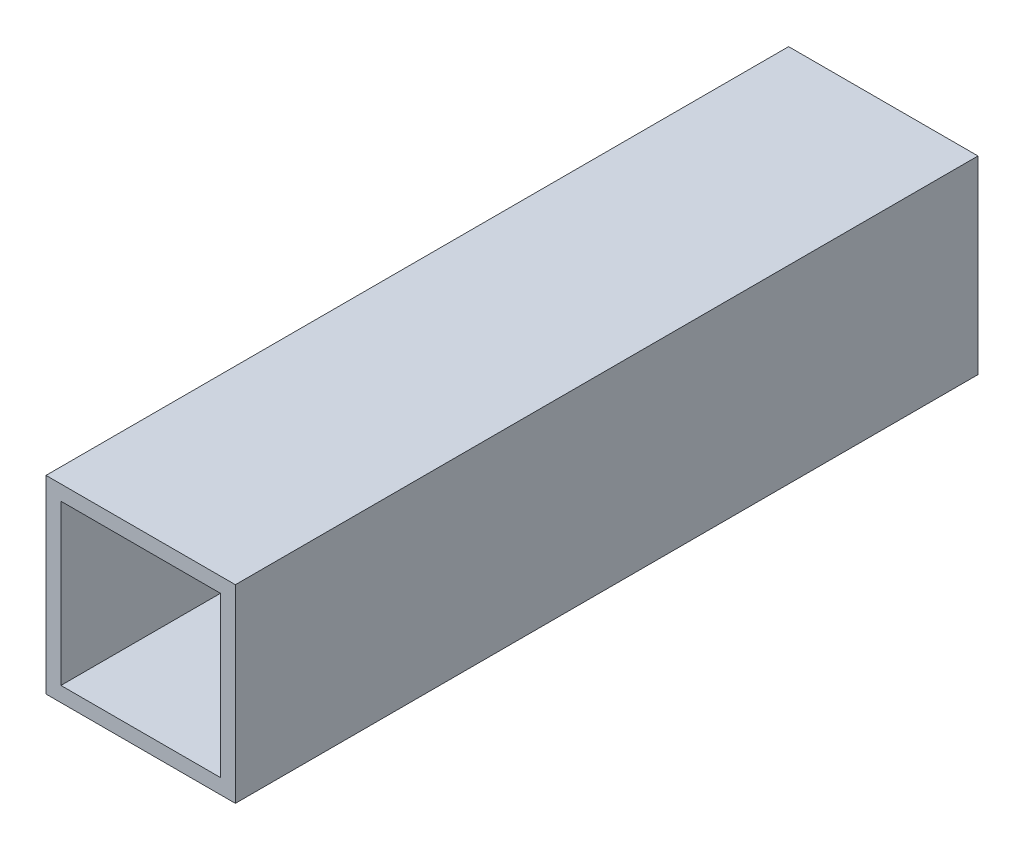
ISO-10303-21;
HEADER;
FILE_DESCRIPTION(('STEP AP214'),'2;1');
FILE_NAME('part.step','',(''),(''),'','','');
FILE_SCHEMA(('AUTOMOTIVE_DESIGN { 1 0 10303 214 1 1 1 1 }'));
ENDSEC;
DATA;
#1=APPLICATION_CONTEXT('core data for automotive mechanical design processes');
#2=APPLICATION_PROTOCOL_DEFINITION('international standard','automotive_design',2000,#1);
#3=PRODUCT_CONTEXT('',#1,'mechanical');
#4=PRODUCT('Part','Part','',(#3));
#5=PRODUCT_RELATED_PRODUCT_CATEGORY('part','',(#4));
#6=PRODUCT_DEFINITION_FORMATION('','',#4);
#7=PRODUCT_DEFINITION_CONTEXT('part definition',#1,'design');
#8=PRODUCT_DEFINITION('design','',#6,#7);
#9=PRODUCT_DEFINITION_SHAPE('','',#8);
#10=(LENGTH_UNIT() NAMED_UNIT(*) SI_UNIT(.MILLI.,.METRE.));
#11=(NAMED_UNIT(*) PLANE_ANGLE_UNIT() SI_UNIT($,.RADIAN.));
#12=(NAMED_UNIT(*) SI_UNIT($,.STERADIAN.) SOLID_ANGLE_UNIT());
#13=UNCERTAINTY_MEASURE_WITH_UNIT(LENGTH_MEASURE(1.E-05),#10,'distance_accuracy_value','');
#14=(GEOMETRIC_REPRESENTATION_CONTEXT(3) GLOBAL_UNCERTAINTY_ASSIGNED_CONTEXT((#13)) GLOBAL_UNIT_ASSIGNED_CONTEXT((#10,
#11,#12)) REPRESENTATION_CONTEXT('',''));
#15=CARTESIAN_POINT('',(0.,0.,0.));
#16=DIRECTION('',(0.,0.,1.));
#17=DIRECTION('',(1.,0.,0.));
#18=AXIS2_PLACEMENT_3D('',#15,#16,#17);
#19=CARTESIAN_POINT('',(0.,0.,99.6));
#20=DIRECTION('',(0.,0.,-1.));
#21=DIRECTION('',(-1.,0.,0.));
#22=AXIS2_PLACEMENT_3D('',#19,#20,#21);
#23=PLANE('',#22);
#24=DIRECTION('',(0.,1.,0.));
#25=VECTOR('',#24,1.);
#26=CARTESIAN_POINT('',(12.7,-12.7,99.6));
#27=LINE('',#26,#25);
#28=CARTESIAN_POINT('',(12.7,-12.7,99.6));
#29=VERTEX_POINT('',#28);
#30=CARTESIAN_POINT('',(12.7,12.7,99.6));
#31=VERTEX_POINT('',#30);
#32=EDGE_CURVE('E157',#29,#31,#27,.T.);
#33=ORIENTED_EDGE('',*,*,#32,.T.);
#34=DIRECTION('',(-1.,0.,0.));
#35=VECTOR('',#34,1.);
#36=CARTESIAN_POINT('',(-12.7,12.7,99.6));
#37=LINE('',#36,#35);
#38=CARTESIAN_POINT('',(-12.7,12.7,99.6));
#39=VERTEX_POINT('',#38);
#40=EDGE_CURVE('E161',#31,#39,#37,.T.);
#41=ORIENTED_EDGE('',*,*,#40,.T.);
#42=DIRECTION('',(0.,-1.,0.));
#43=VECTOR('',#42,1.);
#44=CARTESIAN_POINT('',(-12.7,-12.7,99.6));
#45=LINE('',#44,#43);
#46=CARTESIAN_POINT('',(-12.7,-12.7,99.6));
#47=VERTEX_POINT('',#46);
#48=EDGE_CURVE('E165',#39,#47,#45,.T.);
#49=ORIENTED_EDGE('',*,*,#48,.T.);
#50=DIRECTION('',(1.,0.,0.));
#51=VECTOR('',#50,1.);
#52=CARTESIAN_POINT('',(-12.7,-12.7,99.6));
#53=LINE('',#52,#51);
#54=EDGE_CURVE('E168',#47,#29,#53,.T.);
#55=ORIENTED_EDGE('',*,*,#54,.T.);
#56=EDGE_LOOP('',(#33,#41,#49,#55));
#57=FACE_BOUND('',#56,.T.);
#58=DIRECTION('',(0.,-1.,0.));
#59=VECTOR('',#58,1.);
#60=CARTESIAN_POINT('',(-10.7,-10.7,99.6));
#61=LINE('',#60,#59);
#62=CARTESIAN_POINT('',(-10.7,10.7,99.6));
#63=VERTEX_POINT('',#62);
#64=CARTESIAN_POINT('',(-10.7,-10.7,99.6));
#65=VERTEX_POINT('',#64);
#66=EDGE_CURVE('E109',#63,#65,#61,.T.);
#67=ORIENTED_EDGE('',*,*,#66,.F.);
#68=DIRECTION('',(-1.,0.,0.));
#69=VECTOR('',#68,1.);
#70=CARTESIAN_POINT('',(-10.7,10.7,99.6));
#71=LINE('',#70,#69);
#72=CARTESIAN_POINT('',(10.7,10.7,99.6));
#73=VERTEX_POINT('',#72);
#74=EDGE_CURVE('E135',#73,#63,#71,.T.);
#75=ORIENTED_EDGE('',*,*,#74,.F.);
#76=DIRECTION('',(0.,1.,0.));
#77=VECTOR('',#76,1.);
#78=CARTESIAN_POINT('',(10.7,-10.7,99.6));
#79=LINE('',#78,#77);
#80=CARTESIAN_POINT('',(10.7,-10.7,99.6));
#81=VERTEX_POINT('',#80);
#82=EDGE_CURVE('E131',#81,#73,#79,.T.);
#83=ORIENTED_EDGE('',*,*,#82,.F.);
#84=DIRECTION('',(1.,0.,0.));
#85=VECTOR('',#84,1.);
#86=CARTESIAN_POINT('',(-10.7,-10.7,99.6));
#87=LINE('',#86,#85);
#88=EDGE_CURVE('E118',#65,#81,#87,.T.);
#89=ORIENTED_EDGE('',*,*,#88,.F.);
#90=EDGE_LOOP('',(#67,#75,#83,#89));
#91=FACE_BOUND('',#90,.T.);
#92=ADVANCED_FACE('F43',(#57,#91),#23,.F.);
#93=CARTESIAN_POINT('',(0.,0.,0.));
#94=DIRECTION('',(0.,0.,-1.));
#95=DIRECTION('',(-1.,0.,0.));
#96=AXIS2_PLACEMENT_3D('',#93,#94,#95);
#97=PLANE('',#96);
#98=DIRECTION('',(0.,1.,0.));
#99=VECTOR('',#98,1.);
#100=CARTESIAN_POINT('',(12.7,-12.7,0.));
#101=LINE('',#100,#99);
#102=CARTESIAN_POINT('',(12.7,-12.7,0.));
#103=VERTEX_POINT('',#102);
#104=CARTESIAN_POINT('',(12.7,12.7,0.));
#105=VERTEX_POINT('',#104);
#106=EDGE_CURVE('E127',#103,#105,#101,.T.);
#107=ORIENTED_EDGE('',*,*,#106,.F.);
#108=DIRECTION('',(1.,0.,0.));
#109=VECTOR('',#108,1.);
#110=CARTESIAN_POINT('',(-12.7,-12.7,0.));
#111=LINE('',#110,#109);
#112=CARTESIAN_POINT('',(-12.7,-12.7,0.));
#113=VERTEX_POINT('',#112);
#114=EDGE_CURVE('E162',#113,#103,#111,.T.);
#115=ORIENTED_EDGE('',*,*,#114,.F.);
#116=DIRECTION('',(0.,-1.,0.));
#117=VECTOR('',#116,1.);
#118=CARTESIAN_POINT('',(-12.7,-12.7,0.));
#119=LINE('',#118,#117);
#120=CARTESIAN_POINT('',(-12.7,12.7,0.));
#121=VERTEX_POINT('',#120);
#122=EDGE_CURVE('E178',#121,#113,#119,.T.);
#123=ORIENTED_EDGE('',*,*,#122,.F.);
#124=DIRECTION('',(-1.,0.,0.));
#125=VECTOR('',#124,1.);
#126=CARTESIAN_POINT('',(-12.7,12.7,0.));
#127=LINE('',#126,#125);
#128=EDGE_CURVE('E175',#105,#121,#127,.T.);
#129=ORIENTED_EDGE('',*,*,#128,.F.);
#130=EDGE_LOOP('',(#107,#115,#123,#129));
#131=FACE_BOUND('',#130,.T.);
#132=DIRECTION('',(-1.,0.,0.));
#133=VECTOR('',#132,1.);
#134=CARTESIAN_POINT('',(-10.7,10.7,0.));
#135=LINE('',#134,#133);
#136=CARTESIAN_POINT('',(10.7,10.7,0.));
#137=VERTEX_POINT('',#136);
#138=CARTESIAN_POINT('',(-10.7,10.7,0.));
#139=VERTEX_POINT('',#138);
#140=EDGE_CURVE('E119',#137,#139,#135,.T.);
#141=ORIENTED_EDGE('',*,*,#140,.T.);
#142=DIRECTION('',(0.,-1.,0.));
#143=VECTOR('',#142,1.);
#144=CARTESIAN_POINT('',(-10.7,-10.7,0.));
#145=LINE('',#144,#143);
#146=CARTESIAN_POINT('',(-10.7,-10.7,0.));
#147=VERTEX_POINT('',#146);
#148=EDGE_CURVE('E67',#139,#147,#145,.T.);
#149=ORIENTED_EDGE('',*,*,#148,.T.);
#150=DIRECTION('',(1.,0.,0.));
#151=VECTOR('',#150,1.);
#152=CARTESIAN_POINT('',(-10.7,-10.7,0.));
#153=LINE('',#152,#151);
#154=CARTESIAN_POINT('',(10.7,-10.7,0.));
#155=VERTEX_POINT('',#154);
#156=EDGE_CURVE('E125',#147,#155,#153,.T.);
#157=ORIENTED_EDGE('',*,*,#156,.T.);
#158=DIRECTION('',(0.,1.,0.));
#159=VECTOR('',#158,1.);
#160=CARTESIAN_POINT('',(10.7,-10.7,0.));
#161=LINE('',#160,#159);
#162=EDGE_CURVE('E144',#155,#137,#161,.T.);
#163=ORIENTED_EDGE('',*,*,#162,.T.);
#164=EDGE_LOOP('',(#141,#149,#157,#163));
#165=FACE_BOUND('',#164,.T.);
#166=ADVANCED_FACE('F201',(#131,#165),#97,.T.);
#167=CARTESIAN_POINT('',(12.7,-12.7,99.6));
#168=DIRECTION('',(-1.,0.,0.));
#169=DIRECTION('',(0.,0.,1.));
#170=AXIS2_PLACEMENT_3D('',#167,#168,#169);
#171=PLANE('',#170);
#172=ORIENTED_EDGE('',*,*,#106,.T.);
#173=DIRECTION('',(0.,0.,-1.));
#174=VECTOR('',#173,1.);
#175=CARTESIAN_POINT('',(12.7,12.7,99.6));
#176=LINE('',#175,#174);
#177=EDGE_CURVE('E11',#31,#105,#176,.T.);
#178=ORIENTED_EDGE('',*,*,#177,.F.);
#179=ORIENTED_EDGE('',*,*,#32,.F.);
#180=DIRECTION('',(0.,0.,-1.));
#181=VECTOR('',#180,1.);
#182=CARTESIAN_POINT('',(12.7,-12.7,99.6));
#183=LINE('',#182,#181);
#184=EDGE_CURVE('E171',#29,#103,#183,.T.);
#185=ORIENTED_EDGE('',*,*,#184,.T.);
#186=EDGE_LOOP('',(#172,#178,#179,#185));
#187=FACE_BOUND('',#186,.T.);
#188=ADVANCED_FACE('F45',(#187),#171,.F.);
#189=CARTESIAN_POINT('',(-12.7,12.7,99.6));
#190=DIRECTION('',(0.,-1.,0.));
#191=DIRECTION('',(0.,0.,-1.));
#192=AXIS2_PLACEMENT_3D('',#189,#190,#191);
#193=PLANE('',#192);
#194=ORIENTED_EDGE('',*,*,#128,.T.);
#195=DIRECTION('',(0.,0.,-1.));
#196=VECTOR('',#195,1.);
#197=CARTESIAN_POINT('',(-12.7,12.7,99.6));
#198=LINE('',#197,#196);
#199=EDGE_CURVE('E52',#39,#121,#198,.T.);
#200=ORIENTED_EDGE('',*,*,#199,.F.);
#201=ORIENTED_EDGE('',*,*,#40,.F.);
#202=ORIENTED_EDGE('',*,*,#177,.T.);
#203=EDGE_LOOP('',(#194,#200,#201,#202));
#204=FACE_BOUND('',#203,.T.);
#205=ADVANCED_FACE('F211',(#204),#193,.F.);
#206=CARTESIAN_POINT('',(-12.7,-12.7,99.6));
#207=DIRECTION('',(1.,0.,0.));
#208=DIRECTION('',(0.,0.,-1.));
#209=AXIS2_PLACEMENT_3D('',#206,#207,#208);
#210=PLANE('',#209);
#211=ORIENTED_EDGE('',*,*,#122,.T.);
#212=DIRECTION('',(0.,0.,-1.));
#213=VECTOR('',#212,1.);
#214=CARTESIAN_POINT('',(-12.7,-12.7,99.6));
#215=LINE('',#214,#213);
#216=EDGE_CURVE('E186',#47,#113,#215,.T.);
#217=ORIENTED_EDGE('',*,*,#216,.F.);
#218=ORIENTED_EDGE('',*,*,#48,.F.);
#219=ORIENTED_EDGE('',*,*,#199,.T.);
#220=EDGE_LOOP('',(#211,#217,#218,#219));
#221=FACE_BOUND('',#220,.T.);
#222=ADVANCED_FACE('F195',(#221),#210,.F.);
#223=CARTESIAN_POINT('',(-12.7,-12.7,99.6));
#224=DIRECTION('',(0.,1.,0.));
#225=DIRECTION('',(0.,0.,1.));
#226=AXIS2_PLACEMENT_3D('',#223,#224,#225);
#227=PLANE('',#226);
#228=ORIENTED_EDGE('',*,*,#114,.T.);
#229=ORIENTED_EDGE('',*,*,#184,.F.);
#230=ORIENTED_EDGE('',*,*,#54,.F.);
#231=ORIENTED_EDGE('',*,*,#216,.T.);
#232=EDGE_LOOP('',(#228,#229,#230,#231));
#233=FACE_BOUND('',#232,.T.);
#234=ADVANCED_FACE('F205',(#233),#227,.F.);
#235=CARTESIAN_POINT('',(-10.7,-10.7,99.6));
#236=DIRECTION('',(1.,0.,0.));
#237=DIRECTION('',(0.,0.,-1.));
#238=AXIS2_PLACEMENT_3D('',#235,#236,#237);
#239=PLANE('',#238);
#240=ORIENTED_EDGE('',*,*,#148,.F.);
#241=DIRECTION('',(0.,0.,-1.));
#242=VECTOR('',#241,1.);
#243=CARTESIAN_POINT('',(-10.7,10.7,99.6));
#244=LINE('',#243,#242);
#245=EDGE_CURVE('E113',#63,#139,#244,.T.);
#246=ORIENTED_EDGE('',*,*,#245,.F.);
#247=ORIENTED_EDGE('',*,*,#66,.T.);
#248=DIRECTION('',(0.,0.,-1.));
#249=VECTOR('',#248,1.);
#250=CARTESIAN_POINT('',(-10.7,-10.7,99.6));
#251=LINE('',#250,#249);
#252=EDGE_CURVE('E112',#65,#147,#251,.T.);
#253=ORIENTED_EDGE('',*,*,#252,.T.);
#254=EDGE_LOOP('',(#240,#246,#247,#253));
#255=FACE_BOUND('',#254,.T.);
#256=ADVANCED_FACE('F111',(#255),#239,.T.);
#257=CARTESIAN_POINT('',(-10.7,-10.7,99.6));
#258=DIRECTION('',(0.,1.,0.));
#259=DIRECTION('',(0.,0.,1.));
#260=AXIS2_PLACEMENT_3D('',#257,#258,#259);
#261=PLANE('',#260);
#262=ORIENTED_EDGE('',*,*,#156,.F.);
#263=ORIENTED_EDGE('',*,*,#252,.F.);
#264=ORIENTED_EDGE('',*,*,#88,.T.);
#265=DIRECTION('',(0.,0.,-1.));
#266=VECTOR('',#265,1.);
#267=CARTESIAN_POINT('',(10.7,-10.7,99.6));
#268=LINE('',#267,#266);
#269=EDGE_CURVE('E128',#81,#155,#268,.T.);
#270=ORIENTED_EDGE('',*,*,#269,.T.);
#271=EDGE_LOOP('',(#262,#263,#264,#270));
#272=FACE_BOUND('',#271,.T.);
#273=ADVANCED_FACE('F122',(#272),#261,.T.);
#274=CARTESIAN_POINT('',(10.7,-10.7,99.6));
#275=DIRECTION('',(-1.,0.,0.));
#276=DIRECTION('',(0.,-1.,0.));
#277=AXIS2_PLACEMENT_3D('',#274,#275,#276);
#278=PLANE('',#277);
#279=ORIENTED_EDGE('',*,*,#162,.F.);
#280=ORIENTED_EDGE('',*,*,#269,.F.);
#281=ORIENTED_EDGE('',*,*,#82,.T.);
#282=DIRECTION('',(0.,0.,-1.));
#283=VECTOR('',#282,1.);
#284=CARTESIAN_POINT('',(10.7,10.7,99.6));
#285=LINE('',#284,#283);
#286=EDGE_CURVE('E59',#73,#137,#285,.T.);
#287=ORIENTED_EDGE('',*,*,#286,.T.);
#288=EDGE_LOOP('',(#279,#280,#281,#287));
#289=FACE_BOUND('',#288,.T.);
#290=ADVANCED_FACE('F234',(#289),#278,.T.);
#291=CARTESIAN_POINT('',(-10.7,10.7,99.6));
#292=DIRECTION('',(0.,-1.,0.));
#293=DIRECTION('',(1.,0.,0.));
#294=AXIS2_PLACEMENT_3D('',#291,#292,#293);
#295=PLANE('',#294);
#296=ORIENTED_EDGE('',*,*,#140,.F.);
#297=ORIENTED_EDGE('',*,*,#286,.F.);
#298=ORIENTED_EDGE('',*,*,#74,.T.);
#299=ORIENTED_EDGE('',*,*,#245,.T.);
#300=EDGE_LOOP('',(#296,#297,#298,#299));
#301=FACE_BOUND('',#300,.T.);
#302=ADVANCED_FACE('F238',(#301),#295,.T.);
#303=CLOSED_SHELL('',(#92,#166,#188,#205,#222,#234,#256,#273,#290,#302));
#304=MANIFOLD_SOLID_BREP('B2',#303);
#305=ADVANCED_BREP_SHAPE_REPRESENTATION('',(#18,#304),#14);
#306=SHAPE_DEFINITION_REPRESENTATION(#9,#305);
ENDSEC;
END-ISO-10303-21;
